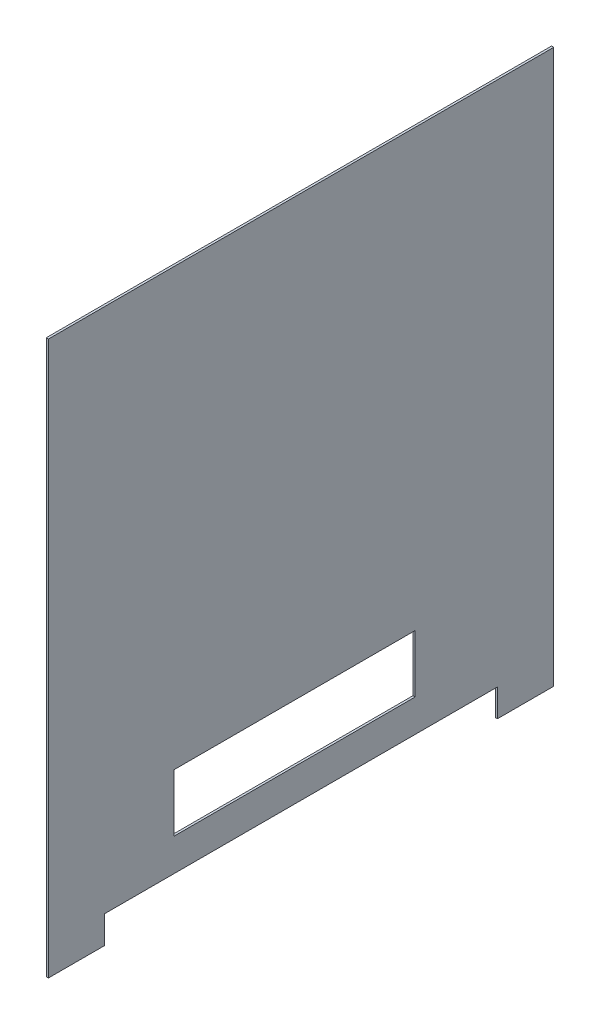
ISO-10303-21;
HEADER;
FILE_DESCRIPTION(('STEP AP214'),'2;1');
FILE_NAME('part.step','',(''),(''),'','','');
FILE_SCHEMA(('AUTOMOTIVE_DESIGN { 1 0 10303 214 1 1 1 1 }'));
ENDSEC;
DATA;
#1=APPLICATION_CONTEXT('core data for automotive mechanical design processes');
#2=APPLICATION_PROTOCOL_DEFINITION('international standard','automotive_design',2000,#1);
#3=PRODUCT_CONTEXT('',#1,'mechanical');
#4=PRODUCT('Part','Part','',(#3));
#5=PRODUCT_RELATED_PRODUCT_CATEGORY('part','',(#4));
#6=PRODUCT_DEFINITION_FORMATION('','',#4);
#7=PRODUCT_DEFINITION_CONTEXT('part definition',#1,'design');
#8=PRODUCT_DEFINITION('design','',#6,#7);
#9=PRODUCT_DEFINITION_SHAPE('','',#8);
#10=(LENGTH_UNIT() NAMED_UNIT(*) SI_UNIT(.MILLI.,.METRE.));
#11=(NAMED_UNIT(*) PLANE_ANGLE_UNIT() SI_UNIT($,.RADIAN.));
#12=(NAMED_UNIT(*) SI_UNIT($,.STERADIAN.) SOLID_ANGLE_UNIT());
#13=UNCERTAINTY_MEASURE_WITH_UNIT(LENGTH_MEASURE(1.E-05),#10,'distance_accuracy_value','');
#14=(GEOMETRIC_REPRESENTATION_CONTEXT(3) GLOBAL_UNCERTAINTY_ASSIGNED_CONTEXT((#13)) GLOBAL_UNIT_ASSIGNED_CONTEXT((#10,
#11,#12)) REPRESENTATION_CONTEXT('',''));
#15=CARTESIAN_POINT('',(0.,0.,0.));
#16=DIRECTION('',(0.,0.,1.));
#17=DIRECTION('',(1.,0.,0.));
#18=AXIS2_PLACEMENT_3D('',#15,#16,#17);
#19=CARTESIAN_POINT('',(2.,-261.070588235294,173.193277310924));
#20=DIRECTION('',(0.,1.,0.));
#21=DIRECTION('',(0.,0.,1.));
#22=AXIS2_PLACEMENT_3D('',#19,#20,#21);
#23=PLANE('',#22);
#24=DIRECTION('',(0.,0.,-1.));
#25=VECTOR('',#24,1.);
#26=CARTESIAN_POINT('',(0.,-261.070588235294,173.193277310924));
#27=LINE('',#26,#25);
#28=CARTESIAN_POINT('',(0.,-261.070588235294,122.193277310924));
#29=VERTEX_POINT('',#28);
#30=CARTESIAN_POINT('',(0.,-261.070588235294,-233.806722689076));
#31=VERTEX_POINT('',#30);
#32=EDGE_CURVE('E216',#29,#31,#27,.T.);
#33=ORIENTED_EDGE('',*,*,#32,.T.);
#34=DIRECTION('',(1.,0.,0.));
#35=VECTOR('',#34,1.);
#36=CARTESIAN_POINT('',(0.,-261.070588235294,-233.806722689076));
#37=LINE('',#36,#35);
#38=CARTESIAN_POINT('',(2.,-261.070588235294,-233.806722689076));
#39=VERTEX_POINT('',#38);
#40=EDGE_CURVE('E173',#31,#39,#37,.T.);
#41=ORIENTED_EDGE('',*,*,#40,.T.);
#42=DIRECTION('',(0.,0.,-1.));
#43=VECTOR('',#42,1.);
#44=CARTESIAN_POINT('',(2.,-261.070588235294,173.193277310924));
#45=LINE('',#44,#43);
#46=CARTESIAN_POINT('',(2.,-261.070588235294,122.193277310924));
#47=VERTEX_POINT('',#46);
#48=EDGE_CURVE('E207',#47,#39,#45,.T.);
#49=ORIENTED_EDGE('',*,*,#48,.F.);
#50=DIRECTION('',(1.,0.,0.));
#51=VECTOR('',#50,1.);
#52=CARTESIAN_POINT('',(0.,-261.070588235294,122.193277310924));
#53=LINE('',#52,#51);
#54=EDGE_CURVE('E197',#29,#47,#53,.T.);
#55=ORIENTED_EDGE('',*,*,#54,.F.);
#56=EDGE_LOOP('',(#33,#41,#49,#55));
#57=FACE_BOUND('',#56,.T.);
#58=ADVANCED_FACE('F41',(#57),#23,.F.);
#59=CARTESIAN_POINT('',(2.,215.529411764706,173.193277310924));
#60=DIRECTION('',(0.,0.,-1.));
#61=DIRECTION('',(0.,1.,0.));
#62=AXIS2_PLACEMENT_3D('',#59,#60,#61);
#63=PLANE('',#62);
#64=DIRECTION('',(0.,-1.,0.));
#65=VECTOR('',#64,1.);
#66=CARTESIAN_POINT('',(0.,215.529411764706,173.193277310924));
#67=LINE('',#66,#65);
#68=CARTESIAN_POINT('',(0.,215.529411764706,173.193277310924));
#69=VERTEX_POINT('',#68);
#70=CARTESIAN_POINT('',(0.,-286.070588235294,173.193277310924));
#71=VERTEX_POINT('',#70);
#72=EDGE_CURVE('E200',#69,#71,#67,.T.);
#73=ORIENTED_EDGE('',*,*,#72,.T.);
#74=DIRECTION('',(1.,0.,0.));
#75=VECTOR('',#74,1.);
#76=CARTESIAN_POINT('',(0.,-286.070588235294,173.193277310924));
#77=LINE('',#76,#75);
#78=CARTESIAN_POINT('',(2.,-286.070588235294,173.193277310924));
#79=VERTEX_POINT('',#78);
#80=EDGE_CURVE('E192',#71,#79,#77,.T.);
#81=ORIENTED_EDGE('',*,*,#80,.T.);
#82=DIRECTION('',(0.,-1.,0.));
#83=VECTOR('',#82,1.);
#84=CARTESIAN_POINT('',(2.,215.529411764706,173.193277310924));
#85=LINE('',#84,#83);
#86=CARTESIAN_POINT('',(2.,215.529411764706,173.193277310924));
#87=VERTEX_POINT('',#86);
#88=EDGE_CURVE('E205',#87,#79,#85,.T.);
#89=ORIENTED_EDGE('',*,*,#88,.F.);
#90=DIRECTION('',(-1.,0.,0.));
#91=VECTOR('',#90,1.);
#92=CARTESIAN_POINT('',(2.,215.529411764706,173.193277310924));
#93=LINE('',#92,#91);
#94=EDGE_CURVE('E49',#87,#69,#93,.T.);
#95=ORIENTED_EDGE('',*,*,#94,.T.);
#96=EDGE_LOOP('',(#73,#81,#89,#95));
#97=FACE_BOUND('',#96,.T.);
#98=ADVANCED_FACE('F43',(#97),#63,.F.);
#99=CARTESIAN_POINT('',(2.,215.529411764706,-284.806722689076));
#100=DIRECTION('',(0.,0.,1.));
#101=DIRECTION('',(1.,0.,0.));
#102=AXIS2_PLACEMENT_3D('',#99,#100,#101);
#103=PLANE('',#102);
#104=DIRECTION('',(0.,1.,0.));
#105=VECTOR('',#104,1.);
#106=CARTESIAN_POINT('',(0.,215.529411764706,-284.806722689076));
#107=LINE('',#106,#105);
#108=CARTESIAN_POINT('',(0.,-286.070588235294,-284.806722689076));
#109=VERTEX_POINT('',#108);
#110=CARTESIAN_POINT('',(0.,215.529411764706,-284.806722689076));
#111=VERTEX_POINT('',#110);
#112=EDGE_CURVE('E218',#109,#111,#107,.T.);
#113=ORIENTED_EDGE('',*,*,#112,.T.);
#114=DIRECTION('',(-1.,0.,0.));
#115=VECTOR('',#114,1.);
#116=CARTESIAN_POINT('',(2.,215.529411764706,-284.806722689076));
#117=LINE('',#116,#115);
#118=CARTESIAN_POINT('',(2.,215.529411764706,-284.806722689076));
#119=VERTEX_POINT('',#118);
#120=EDGE_CURVE('E11',#119,#111,#117,.T.);
#121=ORIENTED_EDGE('',*,*,#120,.F.);
#122=DIRECTION('',(0.,1.,0.));
#123=VECTOR('',#122,1.);
#124=CARTESIAN_POINT('',(2.,215.529411764706,-284.806722689076));
#125=LINE('',#124,#123);
#126=CARTESIAN_POINT('',(2.,-286.070588235294,-284.806722689076));
#127=VERTEX_POINT('',#126);
#128=EDGE_CURVE('E211',#127,#119,#125,.T.);
#129=ORIENTED_EDGE('',*,*,#128,.F.);
#130=DIRECTION('',(1.,0.,0.));
#131=VECTOR('',#130,1.);
#132=CARTESIAN_POINT('',(0.,-286.070588235294,-284.806722689076));
#133=LINE('',#132,#131);
#134=EDGE_CURVE('E178',#109,#127,#133,.T.);
#135=ORIENTED_EDGE('',*,*,#134,.F.);
#136=EDGE_LOOP('',(#113,#121,#129,#135));
#137=FACE_BOUND('',#136,.T.);
#138=ADVANCED_FACE('F241',(#137),#103,.F.);
#139=CARTESIAN_POINT('',(2.,215.529411764706,173.193277310924));
#140=DIRECTION('',(0.,-1.,0.));
#141=DIRECTION('',(0.,0.,-1.));
#142=AXIS2_PLACEMENT_3D('',#139,#140,#141);
#143=PLANE('',#142);
#144=DIRECTION('',(0.,0.,1.));
#145=VECTOR('',#144,1.);
#146=CARTESIAN_POINT('',(0.,215.529411764706,173.193277310924));
#147=LINE('',#146,#145);
#148=EDGE_CURVE('E208',#111,#69,#147,.T.);
#149=ORIENTED_EDGE('',*,*,#148,.T.);
#150=ORIENTED_EDGE('',*,*,#94,.F.);
#151=DIRECTION('',(0.,0.,1.));
#152=VECTOR('',#151,1.);
#153=CARTESIAN_POINT('',(2.,215.529411764706,173.193277310924));
#154=LINE('',#153,#152);
#155=EDGE_CURVE('E213',#119,#87,#154,.T.);
#156=ORIENTED_EDGE('',*,*,#155,.F.);
#157=ORIENTED_EDGE('',*,*,#120,.T.);
#158=EDGE_LOOP('',(#149,#150,#156,#157));
#159=FACE_BOUND('',#158,.T.);
#160=ADVANCED_FACE('F239',(#159),#143,.F.);
#161=CARTESIAN_POINT('',(2.,0.,0.));
#162=DIRECTION('',(1.,0.,0.));
#163=DIRECTION('',(0.,0.,-1.));
#164=AXIS2_PLACEMENT_3D('',#161,#162,#163);
#165=PLANE('',#164);
#166=DIRECTION('',(0.,1.,0.));
#167=VECTOR('',#166,1.);
#168=CARTESIAN_POINT('',(2.,0.,-159.143509041701));
#169=LINE('',#168,#167);
#170=CARTESIAN_POINT('',(2.,-231.653897735819,-159.143509041701));
#171=VERTEX_POINT('',#170);
#172=CARTESIAN_POINT('',(2.,-179.488426732922,-159.143509041701));
#173=VERTEX_POINT('',#172);
#174=EDGE_CURVE('E163',#171,#173,#169,.T.);
#175=ORIENTED_EDGE('',*,*,#174,.F.);
#176=DIRECTION('',(0.,0.,-1.));
#177=VECTOR('',#176,1.);
#178=CARTESIAN_POINT('',(2.,-231.653897735819,0.));
#179=LINE('',#178,#177);
#180=CARTESIAN_POINT('',(2.,-231.653897735819,59.5501963165975));
#181=VERTEX_POINT('',#180);
#182=EDGE_CURVE('E156',#181,#171,#179,.T.);
#183=ORIENTED_EDGE('',*,*,#182,.F.);
#184=DIRECTION('',(0.,-1.,0.));
#185=VECTOR('',#184,1.);
#186=CARTESIAN_POINT('',(2.,0.,59.5501963165975));
#187=LINE('',#186,#185);
#188=CARTESIAN_POINT('',(2.,-179.488426732922,59.5501963165975));
#189=VERTEX_POINT('',#188);
#190=EDGE_CURVE('E136',#189,#181,#187,.T.);
#191=ORIENTED_EDGE('',*,*,#190,.F.);
#192=DIRECTION('',(0.,0.,1.));
#193=VECTOR('',#192,1.);
#194=CARTESIAN_POINT('',(2.,-179.488426732922,0.));
#195=LINE('',#194,#193);
#196=EDGE_CURVE('E161',#173,#189,#195,.T.);
#197=ORIENTED_EDGE('',*,*,#196,.F.);
#198=EDGE_LOOP('',(#175,#183,#191,#197));
#199=FACE_BOUND('',#198,.T.);
#200=ORIENTED_EDGE('',*,*,#88,.T.);
#201=DIRECTION('',(0.,0.,-1.));
#202=VECTOR('',#201,1.);
#203=CARTESIAN_POINT('',(2.,-286.070588235294,173.193277310924));
#204=LINE('',#203,#202);
#205=CARTESIAN_POINT('',(2.,-286.070588235294,122.193277310924));
#206=VERTEX_POINT('',#205);
#207=EDGE_CURVE('E181',#79,#206,#204,.T.);
#208=ORIENTED_EDGE('',*,*,#207,.T.);
#209=DIRECTION('',(0.,1.,0.));
#210=VECTOR('',#209,1.);
#211=CARTESIAN_POINT('',(2.,-261.070588235294,122.193277310924));
#212=LINE('',#211,#210);
#213=EDGE_CURVE('E189',#206,#47,#212,.T.);
#214=ORIENTED_EDGE('',*,*,#213,.T.);
#215=ORIENTED_EDGE('',*,*,#48,.T.);
#216=DIRECTION('',(0.,-1.,0.));
#217=VECTOR('',#216,1.);
#218=CARTESIAN_POINT('',(2.,-261.070588235294,-233.806722689076));
#219=LINE('',#218,#217);
#220=CARTESIAN_POINT('',(2.,-286.070588235294,-233.806722689076));
#221=VERTEX_POINT('',#220);
#222=EDGE_CURVE('E165',#39,#221,#219,.T.);
#223=ORIENTED_EDGE('',*,*,#222,.T.);
#224=DIRECTION('',(0.,0.,-1.));
#225=VECTOR('',#224,1.);
#226=CARTESIAN_POINT('',(2.,-286.070588235294,-284.806722689076));
#227=LINE('',#226,#225);
#228=EDGE_CURVE('E170',#221,#127,#227,.T.);
#229=ORIENTED_EDGE('',*,*,#228,.T.);
#230=ORIENTED_EDGE('',*,*,#128,.T.);
#231=ORIENTED_EDGE('',*,*,#155,.T.);
#232=EDGE_LOOP('',(#200,#208,#214,#215,#223,#229,#230,#231));
#233=FACE_BOUND('',#232,.T.);
#234=ADVANCED_FACE('F237',(#199,#233),#165,.T.);
#235=CARTESIAN_POINT('',(0.,0.,0.));
#236=DIRECTION('',(1.,0.,0.));
#237=DIRECTION('',(0.,0.,-1.));
#238=AXIS2_PLACEMENT_3D('',#235,#236,#237);
#239=PLANE('',#238);
#240=DIRECTION('',(0.,0.,1.));
#241=VECTOR('',#240,1.);
#242=CARTESIAN_POINT('',(0.,-231.653897735819,-159.143509041701));
#243=LINE('',#242,#241);
#244=CARTESIAN_POINT('',(0.,-231.653897735819,-159.143509041701));
#245=VERTEX_POINT('',#244);
#246=CARTESIAN_POINT('',(0.,-231.653897735819,59.5501963165975));
#247=VERTEX_POINT('',#246);
#248=EDGE_CURVE('E142',#245,#247,#243,.T.);
#249=ORIENTED_EDGE('',*,*,#248,.F.);
#250=DIRECTION('',(0.,-1.,0.));
#251=VECTOR('',#250,1.);
#252=CARTESIAN_POINT('',(0.,-179.488426732922,-159.143509041701));
#253=LINE('',#252,#251);
#254=CARTESIAN_POINT('',(0.,-179.488426732922,-159.143509041701));
#255=VERTEX_POINT('',#254);
#256=EDGE_CURVE('E64',#255,#245,#253,.T.);
#257=ORIENTED_EDGE('',*,*,#256,.F.);
#258=DIRECTION('',(0.,0.,-1.));
#259=VECTOR('',#258,1.);
#260=CARTESIAN_POINT('',(0.,-179.488426732922,-159.143509041701));
#261=LINE('',#260,#259);
#262=CARTESIAN_POINT('',(0.,-179.488426732922,59.5501963165975));
#263=VERTEX_POINT('',#262);
#264=EDGE_CURVE('E149',#263,#255,#261,.T.);
#265=ORIENTED_EDGE('',*,*,#264,.F.);
#266=DIRECTION('',(0.,1.,0.));
#267=VECTOR('',#266,1.);
#268=CARTESIAN_POINT('',(0.,-179.488426732922,59.5501963165975));
#269=LINE('',#268,#267);
#270=EDGE_CURVE('E133',#247,#263,#269,.T.);
#271=ORIENTED_EDGE('',*,*,#270,.F.);
#272=EDGE_LOOP('',(#249,#257,#265,#271));
#273=FACE_BOUND('',#272,.T.);
#274=ORIENTED_EDGE('',*,*,#72,.F.);
#275=ORIENTED_EDGE('',*,*,#148,.F.);
#276=ORIENTED_EDGE('',*,*,#112,.F.);
#277=DIRECTION('',(0.,0.,-1.));
#278=VECTOR('',#277,1.);
#279=CARTESIAN_POINT('',(0.,-286.070588235294,-284.806722689076));
#280=LINE('',#279,#278);
#281=CARTESIAN_POINT('',(0.,-286.070588235294,-233.806722689076));
#282=VERTEX_POINT('',#281);
#283=EDGE_CURVE('E169',#282,#109,#280,.T.);
#284=ORIENTED_EDGE('',*,*,#283,.F.);
#285=DIRECTION('',(0.,-1.,0.));
#286=VECTOR('',#285,1.);
#287=CARTESIAN_POINT('',(0.,-261.070588235294,-233.806722689076));
#288=LINE('',#287,#286);
#289=EDGE_CURVE('E166',#31,#282,#288,.T.);
#290=ORIENTED_EDGE('',*,*,#289,.F.);
#291=ORIENTED_EDGE('',*,*,#32,.F.);
#292=DIRECTION('',(0.,1.,0.));
#293=VECTOR('',#292,1.);
#294=CARTESIAN_POINT('',(0.,-261.070588235294,122.193277310924));
#295=LINE('',#294,#293);
#296=CARTESIAN_POINT('',(0.,-286.070588235294,122.193277310924));
#297=VERTEX_POINT('',#296);
#298=EDGE_CURVE('E188',#297,#29,#295,.T.);
#299=ORIENTED_EDGE('',*,*,#298,.F.);
#300=DIRECTION('',(0.,0.,-1.));
#301=VECTOR('',#300,1.);
#302=CARTESIAN_POINT('',(0.,-286.070588235294,173.193277310924));
#303=LINE('',#302,#301);
#304=EDGE_CURVE('E185',#71,#297,#303,.T.);
#305=ORIENTED_EDGE('',*,*,#304,.F.);
#306=EDGE_LOOP('',(#274,#275,#276,#284,#290,#291,#299,#305));
#307=FACE_BOUND('',#306,.T.);
#308=ADVANCED_FACE('F146',(#273,#307),#239,.F.);
#309=CARTESIAN_POINT('',(0.,-261.070588235294,122.193277310924));
#310=DIRECTION('',(0.,0.,-1.));
#311=DIRECTION('',(-1.,0.,0.));
#312=AXIS2_PLACEMENT_3D('',#309,#310,#311);
#313=PLANE('',#312);
#314=ORIENTED_EDGE('',*,*,#213,.F.);
#315=DIRECTION('',(1.,0.,0.));
#316=VECTOR('',#315,1.);
#317=CARTESIAN_POINT('',(0.,-286.070588235294,122.193277310924));
#318=LINE('',#317,#316);
#319=EDGE_CURVE('E201',#297,#206,#318,.T.);
#320=ORIENTED_EDGE('',*,*,#319,.F.);
#321=ORIENTED_EDGE('',*,*,#298,.T.);
#322=ORIENTED_EDGE('',*,*,#54,.T.);
#323=EDGE_LOOP('',(#314,#320,#321,#322));
#324=FACE_BOUND('',#323,.T.);
#325=ADVANCED_FACE('F254',(#324),#313,.T.);
#326=CARTESIAN_POINT('',(0.,-286.070588235294,173.193277310924));
#327=DIRECTION('',(0.,-1.,0.));
#328=DIRECTION('',(0.,0.,-1.));
#329=AXIS2_PLACEMENT_3D('',#326,#327,#328);
#330=PLANE('',#329);
#331=ORIENTED_EDGE('',*,*,#207,.F.);
#332=ORIENTED_EDGE('',*,*,#80,.F.);
#333=ORIENTED_EDGE('',*,*,#304,.T.);
#334=ORIENTED_EDGE('',*,*,#319,.T.);
#335=EDGE_LOOP('',(#331,#332,#333,#334));
#336=FACE_BOUND('',#335,.T.);
#337=ADVANCED_FACE('F234',(#336),#330,.T.);
#338=CARTESIAN_POINT('',(0.,-286.070588235294,-284.806722689076));
#339=DIRECTION('',(0.,-1.,0.));
#340=DIRECTION('',(0.,0.,-1.));
#341=AXIS2_PLACEMENT_3D('',#338,#339,#340);
#342=PLANE('',#341);
#343=ORIENTED_EDGE('',*,*,#228,.F.);
#344=DIRECTION('',(1.,0.,0.));
#345=VECTOR('',#344,1.);
#346=CARTESIAN_POINT('',(0.,-286.070588235294,-233.806722689076));
#347=LINE('',#346,#345);
#348=EDGE_CURVE('E182',#282,#221,#347,.T.);
#349=ORIENTED_EDGE('',*,*,#348,.F.);
#350=ORIENTED_EDGE('',*,*,#283,.T.);
#351=ORIENTED_EDGE('',*,*,#134,.T.);
#352=EDGE_LOOP('',(#343,#349,#350,#351));
#353=FACE_BOUND('',#352,.T.);
#354=ADVANCED_FACE('F247',(#353),#342,.T.);
#355=CARTESIAN_POINT('',(0.,-261.070588235294,-233.806722689076));
#356=DIRECTION('',(0.,0.,1.));
#357=DIRECTION('',(1.,0.,0.));
#358=AXIS2_PLACEMENT_3D('',#355,#356,#357);
#359=PLANE('',#358);
#360=ORIENTED_EDGE('',*,*,#222,.F.);
#361=ORIENTED_EDGE('',*,*,#40,.F.);
#362=ORIENTED_EDGE('',*,*,#289,.T.);
#363=ORIENTED_EDGE('',*,*,#348,.T.);
#364=EDGE_LOOP('',(#360,#361,#362,#363));
#365=FACE_BOUND('',#364,.T.);
#366=ADVANCED_FACE('F251',(#365),#359,.T.);
#367=CARTESIAN_POINT('',(10.,-179.488426732922,-159.143509041701));
#368=DIRECTION('',(0.,0.,-1.));
#369=DIRECTION('',(-1.,0.,0.));
#370=AXIS2_PLACEMENT_3D('',#367,#368,#369);
#371=PLANE('',#370);
#372=ORIENTED_EDGE('',*,*,#174,.T.);
#373=DIRECTION('',(-1.,0.,0.));
#374=VECTOR('',#373,1.);
#375=CARTESIAN_POINT('',(10.,-179.488426732922,-159.143509041701));
#376=LINE('',#375,#374);
#377=EDGE_CURVE('E154',#173,#255,#376,.T.);
#378=ORIENTED_EDGE('',*,*,#377,.T.);
#379=ORIENTED_EDGE('',*,*,#256,.T.);
#380=DIRECTION('',(-1.,0.,0.));
#381=VECTOR('',#380,1.);
#382=CARTESIAN_POINT('',(10.,-231.653897735819,-159.143509041701));
#383=LINE('',#382,#381);
#384=EDGE_CURVE('E139',#171,#245,#383,.T.);
#385=ORIENTED_EDGE('',*,*,#384,.F.);
#386=EDGE_LOOP('',(#372,#378,#379,#385));
#387=FACE_BOUND('',#386,.T.);
#388=ADVANCED_FACE('F282',(#387),#371,.F.);
#389=CARTESIAN_POINT('',(10.,-179.488426732922,-159.143509041701));
#390=DIRECTION('',(0.,1.,0.));
#391=DIRECTION('',(0.,0.,1.));
#392=AXIS2_PLACEMENT_3D('',#389,#390,#391);
#393=PLANE('',#392);
#394=ORIENTED_EDGE('',*,*,#196,.T.);
#395=DIRECTION('',(-1.,0.,0.));
#396=VECTOR('',#395,1.);
#397=CARTESIAN_POINT('',(10.,-179.488426732922,59.5501963165975));
#398=LINE('',#397,#396);
#399=EDGE_CURVE('E138',#189,#263,#398,.T.);
#400=ORIENTED_EDGE('',*,*,#399,.T.);
#401=ORIENTED_EDGE('',*,*,#264,.T.);
#402=ORIENTED_EDGE('',*,*,#377,.F.);
#403=EDGE_LOOP('',(#394,#400,#401,#402));
#404=FACE_BOUND('',#403,.T.);
#405=ADVANCED_FACE('F284',(#404),#393,.F.);
#406=CARTESIAN_POINT('',(10.,-179.488426732922,59.5501963165975));
#407=DIRECTION('',(0.,0.,1.));
#408=DIRECTION('',(1.,0.,0.));
#409=AXIS2_PLACEMENT_3D('',#406,#407,#408);
#410=PLANE('',#409);
#411=ORIENTED_EDGE('',*,*,#190,.T.);
#412=DIRECTION('',(-1.,0.,0.));
#413=VECTOR('',#412,1.);
#414=CARTESIAN_POINT('',(10.,-231.653897735819,59.5501963165975));
#415=LINE('',#414,#413);
#416=EDGE_CURVE('E56',#181,#247,#415,.T.);
#417=ORIENTED_EDGE('',*,*,#416,.T.);
#418=ORIENTED_EDGE('',*,*,#270,.T.);
#419=ORIENTED_EDGE('',*,*,#399,.F.);
#420=EDGE_LOOP('',(#411,#417,#418,#419));
#421=FACE_BOUND('',#420,.T.);
#422=ADVANCED_FACE('F130',(#421),#410,.F.);
#423=CARTESIAN_POINT('',(10.,-231.653897735819,-159.143509041701));
#424=DIRECTION('',(0.,-1.,0.));
#425=DIRECTION('',(0.,0.,-1.));
#426=AXIS2_PLACEMENT_3D('',#423,#424,#425);
#427=PLANE('',#426);
#428=ORIENTED_EDGE('',*,*,#182,.T.);
#429=ORIENTED_EDGE('',*,*,#384,.T.);
#430=ORIENTED_EDGE('',*,*,#248,.T.);
#431=ORIENTED_EDGE('',*,*,#416,.F.);
#432=EDGE_LOOP('',(#428,#429,#430,#431));
#433=FACE_BOUND('',#432,.T.);
#434=ADVANCED_FACE('F143',(#433),#427,.F.);
#435=CLOSED_SHELL('',(#58,#98,#138,#160,#234,#308,#325,#337,#354,#366,#388,#405,#422,#434));
#436=MANIFOLD_SOLID_BREP('B2',#435);
#437=ADVANCED_BREP_SHAPE_REPRESENTATION('',(#18,#436),#14);
#438=SHAPE_DEFINITION_REPRESENTATION(#9,#437);
ENDSEC;
END-ISO-10303-21;
